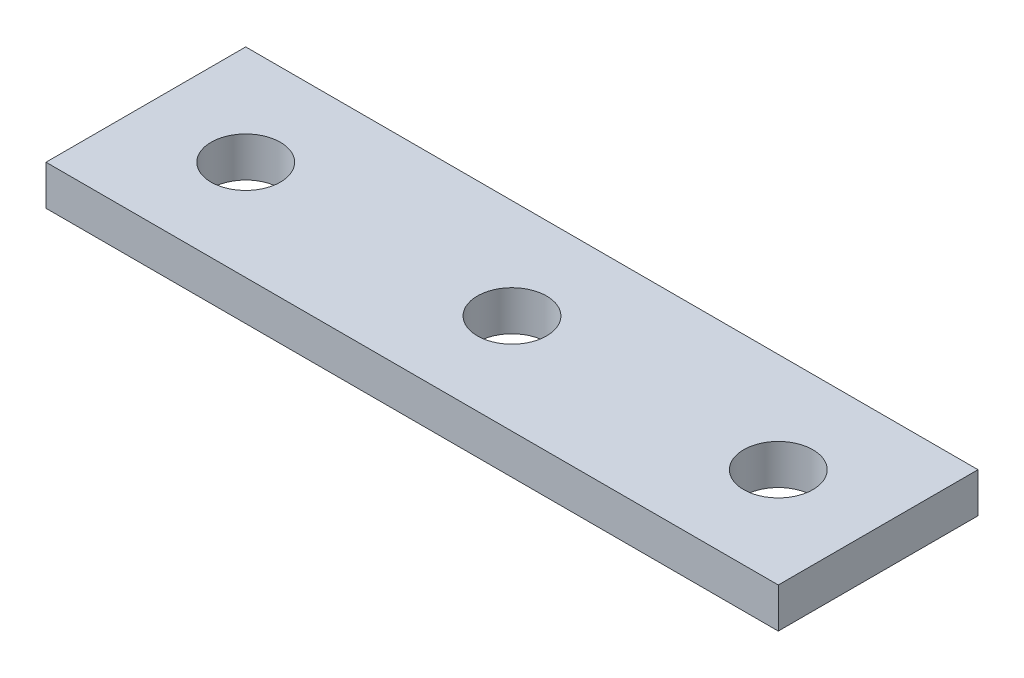
ISO-10303-21;
HEADER;
FILE_DESCRIPTION(('STEP AP214'),'2;1');
FILE_NAME('part.step','',(''),(''),'','','');
FILE_SCHEMA(('AUTOMOTIVE_DESIGN { 1 0 10303 214 1 1 1 1 }'));
ENDSEC;
DATA;
#1=APPLICATION_CONTEXT('core data for automotive mechanical design processes');
#2=APPLICATION_PROTOCOL_DEFINITION('international standard','automotive_design',2000,#1);
#3=PRODUCT_CONTEXT('',#1,'mechanical');
#4=PRODUCT('Part','Part','',(#3));
#5=PRODUCT_RELATED_PRODUCT_CATEGORY('part','',(#4));
#6=PRODUCT_DEFINITION_FORMATION('','',#4);
#7=PRODUCT_DEFINITION_CONTEXT('part definition',#1,'design');
#8=PRODUCT_DEFINITION('design','',#6,#7);
#9=PRODUCT_DEFINITION_SHAPE('','',#8);
#10=(LENGTH_UNIT() NAMED_UNIT(*) SI_UNIT(.MILLI.,.METRE.));
#11=(NAMED_UNIT(*) PLANE_ANGLE_UNIT() SI_UNIT($,.RADIAN.));
#12=(NAMED_UNIT(*) SI_UNIT($,.STERADIAN.) SOLID_ANGLE_UNIT());
#13=UNCERTAINTY_MEASURE_WITH_UNIT(LENGTH_MEASURE(1.E-05),#10,'distance_accuracy_value','');
#14=(GEOMETRIC_REPRESENTATION_CONTEXT(3) GLOBAL_UNCERTAINTY_ASSIGNED_CONTEXT((#13)) GLOBAL_UNIT_ASSIGNED_CONTEXT((#10,
#11,#12)) REPRESENTATION_CONTEXT('',''));
#15=CARTESIAN_POINT('',(0.,0.,0.));
#16=DIRECTION('',(0.,0.,1.));
#17=DIRECTION('',(1.,0.,0.));
#18=AXIS2_PLACEMENT_3D('',#15,#16,#17);
#19=CARTESIAN_POINT('',(0.,3.,0.));
#20=DIRECTION('',(0.,1.,0.));
#21=DIRECTION('',(0.,0.,1.));
#22=AXIS2_PLACEMENT_3D('',#19,#20,#21);
#23=PLANE('',#22);
#24=CARTESIAN_POINT('',(20.,3.,0.));
#25=DIRECTION('',(0.,1.,0.));
#26=DIRECTION('',(0.,0.,1.));
#27=AXIS2_PLACEMENT_3D('',#24,#25,#26);
#28=CIRCLE('',#27,2.6);
#29=CARTESIAN_POINT('',(20.,3.,2.6));
#30=VERTEX_POINT('',#29);
#31=EDGE_CURVE('E116',#30,#30,#28,.T.);
#32=ORIENTED_EDGE('',*,*,#31,.F.);
#33=EDGE_LOOP('',(#32));
#34=FACE_BOUND('',#33,.T.);
#35=DIRECTION('',(0.,0.,-1.));
#36=VECTOR('',#35,1.);
#37=CARTESIAN_POINT('',(27.5,3.,-7.5));
#38=LINE('',#37,#36);
#39=CARTESIAN_POINT('',(27.5,3.,7.5));
#40=VERTEX_POINT('',#39);
#41=CARTESIAN_POINT('',(27.5,3.,-7.5));
#42=VERTEX_POINT('',#41);
#43=EDGE_CURVE('E86',#40,#42,#38,.T.);
#44=ORIENTED_EDGE('',*,*,#43,.T.);
#45=DIRECTION('',(-1.,0.,0.));
#46=VECTOR('',#45,1.);
#47=CARTESIAN_POINT('',(-27.5,3.,-7.5));
#48=LINE('',#47,#46);
#49=CARTESIAN_POINT('',(-27.5,3.,-7.5));
#50=VERTEX_POINT('',#49);
#51=EDGE_CURVE('E81',#42,#50,#48,.T.);
#52=ORIENTED_EDGE('',*,*,#51,.T.);
#53=DIRECTION('',(0.,0.,1.));
#54=VECTOR('',#53,1.);
#55=CARTESIAN_POINT('',(-27.5,3.,-7.5));
#56=LINE('',#55,#54);
#57=CARTESIAN_POINT('',(-27.5,3.,7.5));
#58=VERTEX_POINT('',#57);
#59=EDGE_CURVE('E84',#50,#58,#56,.T.);
#60=ORIENTED_EDGE('',*,*,#59,.T.);
#61=DIRECTION('',(1.,0.,0.));
#62=VECTOR('',#61,1.);
#63=CARTESIAN_POINT('',(-27.5,3.,7.5));
#64=LINE('',#63,#62);
#65=EDGE_CURVE('E51',#58,#40,#64,.T.);
#66=ORIENTED_EDGE('',*,*,#65,.T.);
#67=EDGE_LOOP('',(#44,#52,#60,#66));
#68=FACE_BOUND('',#67,.T.);
#69=CARTESIAN_POINT('',(0.,3.,0.));
#70=DIRECTION('',(0.,1.,0.));
#71=DIRECTION('',(0.,0.,1.));
#72=AXIS2_PLACEMENT_3D('',#69,#70,#71);
#73=CIRCLE('',#72,2.6);
#74=CARTESIAN_POINT('',(0.,3.,2.6));
#75=VERTEX_POINT('',#74);
#76=EDGE_CURVE('E101',#75,#75,#73,.T.);
#77=ORIENTED_EDGE('',*,*,#76,.F.);
#78=EDGE_LOOP('',(#77));
#79=FACE_BOUND('',#78,.T.);
#80=CARTESIAN_POINT('',(-20.,3.,0.));
#81=DIRECTION('',(0.,1.,0.));
#82=DIRECTION('',(0.,0.,1.));
#83=AXIS2_PLACEMENT_3D('',#80,#81,#82);
#84=CIRCLE('',#83,2.6);
#85=CARTESIAN_POINT('',(-20.,3.,2.6));
#86=VERTEX_POINT('',#85);
#87=EDGE_CURVE('E122',#86,#86,#84,.T.);
#88=ORIENTED_EDGE('',*,*,#87,.F.);
#89=EDGE_LOOP('',(#88));
#90=FACE_BOUND('',#89,.T.);
#91=ADVANCED_FACE('F34',(#34,#68,#79,#90),#23,.T.);
#92=CARTESIAN_POINT('',(0.,0.,0.));
#93=DIRECTION('',(0.,1.,0.));
#94=DIRECTION('',(0.,0.,1.));
#95=AXIS2_PLACEMENT_3D('',#92,#93,#94);
#96=PLANE('',#95);
#97=DIRECTION('',(0.,0.,-1.));
#98=VECTOR('',#97,1.);
#99=CARTESIAN_POINT('',(27.5,0.,-7.5));
#100=LINE('',#99,#98);
#101=CARTESIAN_POINT('',(27.5,0.,7.5));
#102=VERTEX_POINT('',#101);
#103=CARTESIAN_POINT('',(27.5,0.,-7.5));
#104=VERTEX_POINT('',#103);
#105=EDGE_CURVE('E98',#102,#104,#100,.T.);
#106=ORIENTED_EDGE('',*,*,#105,.F.);
#107=DIRECTION('',(1.,0.,0.));
#108=VECTOR('',#107,1.);
#109=CARTESIAN_POINT('',(-27.5,0.,7.5));
#110=LINE('',#109,#108);
#111=CARTESIAN_POINT('',(-27.5,0.,7.5));
#112=VERTEX_POINT('',#111);
#113=EDGE_CURVE('E74',#112,#102,#110,.T.);
#114=ORIENTED_EDGE('',*,*,#113,.F.);
#115=DIRECTION('',(0.,0.,1.));
#116=VECTOR('',#115,1.);
#117=CARTESIAN_POINT('',(-27.5,0.,-7.5));
#118=LINE('',#117,#116);
#119=CARTESIAN_POINT('',(-27.5,0.,-7.5));
#120=VERTEX_POINT('',#119);
#121=EDGE_CURVE('E68',#120,#112,#118,.T.);
#122=ORIENTED_EDGE('',*,*,#121,.F.);
#123=DIRECTION('',(-1.,0.,0.));
#124=VECTOR('',#123,1.);
#125=CARTESIAN_POINT('',(-27.5,0.,-7.5));
#126=LINE('',#125,#124);
#127=EDGE_CURVE('E90',#104,#120,#126,.T.);
#128=ORIENTED_EDGE('',*,*,#127,.F.);
#129=EDGE_LOOP('',(#106,#114,#122,#128));
#130=FACE_BOUND('',#129,.T.);
#131=CARTESIAN_POINT('',(0.,0.,0.));
#132=DIRECTION('',(0.,1.,0.));
#133=DIRECTION('',(0.,0.,1.));
#134=AXIS2_PLACEMENT_3D('',#131,#132,#133);
#135=CIRCLE('',#134,2.6);
#136=CARTESIAN_POINT('',(0.,0.,2.6));
#137=VERTEX_POINT('',#136);
#138=EDGE_CURVE('E113',#137,#137,#135,.T.);
#139=ORIENTED_EDGE('',*,*,#138,.T.);
#140=EDGE_LOOP('',(#139));
#141=FACE_BOUND('',#140,.T.);
#142=CARTESIAN_POINT('',(20.,0.,0.));
#143=DIRECTION('',(0.,1.,0.));
#144=DIRECTION('',(0.,0.,1.));
#145=AXIS2_PLACEMENT_3D('',#142,#143,#144);
#146=CIRCLE('',#145,2.6);
#147=CARTESIAN_POINT('',(20.,0.,2.6));
#148=VERTEX_POINT('',#147);
#149=EDGE_CURVE('E119',#148,#148,#146,.T.);
#150=ORIENTED_EDGE('',*,*,#149,.T.);
#151=EDGE_LOOP('',(#150));
#152=FACE_BOUND('',#151,.T.);
#153=CARTESIAN_POINT('',(-20.,0.,0.));
#154=DIRECTION('',(0.,1.,0.));
#155=DIRECTION('',(0.,0.,1.));
#156=AXIS2_PLACEMENT_3D('',#153,#154,#155);
#157=CIRCLE('',#156,2.6);
#158=CARTESIAN_POINT('',(-20.,0.,2.6));
#159=VERTEX_POINT('',#158);
#160=EDGE_CURVE('E125',#159,#159,#157,.T.);
#161=ORIENTED_EDGE('',*,*,#160,.T.);
#162=EDGE_LOOP('',(#161));
#163=FACE_BOUND('',#162,.T.);
#164=ADVANCED_FACE('F109',(#130,#141,#152,#163),#96,.F.);
#165=CARTESIAN_POINT('',(27.5,3.,-7.5));
#166=DIRECTION('',(-1.,0.,0.));
#167=DIRECTION('',(0.,0.,1.));
#168=AXIS2_PLACEMENT_3D('',#165,#166,#167);
#169=PLANE('',#168);
#170=ORIENTED_EDGE('',*,*,#105,.T.);
#171=DIRECTION('',(0.,-1.,0.));
#172=VECTOR('',#171,1.);
#173=CARTESIAN_POINT('',(27.5,3.,-7.5));
#174=LINE('',#173,#172);
#175=EDGE_CURVE('E11',#42,#104,#174,.T.);
#176=ORIENTED_EDGE('',*,*,#175,.F.);
#177=ORIENTED_EDGE('',*,*,#43,.F.);
#178=DIRECTION('',(0.,-1.,0.));
#179=VECTOR('',#178,1.);
#180=CARTESIAN_POINT('',(27.5,3.,7.5));
#181=LINE('',#180,#179);
#182=EDGE_CURVE('E94',#40,#102,#181,.T.);
#183=ORIENTED_EDGE('',*,*,#182,.T.);
#184=EDGE_LOOP('',(#170,#176,#177,#183));
#185=FACE_BOUND('',#184,.T.);
#186=ADVANCED_FACE('F36',(#185),#169,.F.);
#187=CARTESIAN_POINT('',(-27.5,3.,-7.5));
#188=DIRECTION('',(0.,0.,1.));
#189=DIRECTION('',(1.,0.,0.));
#190=AXIS2_PLACEMENT_3D('',#187,#188,#189);
#191=PLANE('',#190);
#192=ORIENTED_EDGE('',*,*,#127,.T.);
#193=DIRECTION('',(0.,-1.,0.));
#194=VECTOR('',#193,1.);
#195=CARTESIAN_POINT('',(-27.5,3.,-7.5));
#196=LINE('',#195,#194);
#197=EDGE_CURVE('E43',#50,#120,#196,.T.);
#198=ORIENTED_EDGE('',*,*,#197,.F.);
#199=ORIENTED_EDGE('',*,*,#51,.F.);
#200=ORIENTED_EDGE('',*,*,#175,.T.);
#201=EDGE_LOOP('',(#192,#198,#199,#200));
#202=FACE_BOUND('',#201,.T.);
#203=ADVANCED_FACE('F89',(#202),#191,.F.);
#204=CARTESIAN_POINT('',(-27.5,3.,-7.5));
#205=DIRECTION('',(1.,0.,0.));
#206=DIRECTION('',(0.,0.,-1.));
#207=AXIS2_PLACEMENT_3D('',#204,#205,#206);
#208=PLANE('',#207);
#209=ORIENTED_EDGE('',*,*,#121,.T.);
#210=DIRECTION('',(0.,-1.,0.));
#211=VECTOR('',#210,1.);
#212=CARTESIAN_POINT('',(-27.5,3.,7.5));
#213=LINE('',#212,#211);
#214=EDGE_CURVE('E91',#58,#112,#213,.T.);
#215=ORIENTED_EDGE('',*,*,#214,.F.);
#216=ORIENTED_EDGE('',*,*,#59,.F.);
#217=ORIENTED_EDGE('',*,*,#197,.T.);
#218=EDGE_LOOP('',(#209,#215,#216,#217));
#219=FACE_BOUND('',#218,.T.);
#220=ADVANCED_FACE('F92',(#219),#208,.F.);
#221=CARTESIAN_POINT('',(-27.5,3.,7.5));
#222=DIRECTION('',(0.,0.,-1.));
#223=DIRECTION('',(-1.,0.,0.));
#224=AXIS2_PLACEMENT_3D('',#221,#222,#223);
#225=PLANE('',#224);
#226=ORIENTED_EDGE('',*,*,#113,.T.);
#227=ORIENTED_EDGE('',*,*,#182,.F.);
#228=ORIENTED_EDGE('',*,*,#65,.F.);
#229=ORIENTED_EDGE('',*,*,#214,.T.);
#230=EDGE_LOOP('',(#226,#227,#228,#229));
#231=FACE_BOUND('',#230,.T.);
#232=ADVANCED_FACE('F106',(#231),#225,.F.);
#233=CARTESIAN_POINT('',(0.,3.,0.));
#234=DIRECTION('',(0.,-1.,0.));
#235=DIRECTION('',(0.,0.,-1.));
#236=AXIS2_PLACEMENT_3D('',#233,#234,#235);
#237=CYLINDRICAL_SURFACE('',#236,2.6);
#238=ORIENTED_EDGE('',*,*,#76,.T.);
#239=EDGE_LOOP('',(#238));
#240=FACE_BOUND('',#239,.T.);
#241=ORIENTED_EDGE('',*,*,#138,.F.);
#242=EDGE_LOOP('',(#241));
#243=FACE_BOUND('',#242,.T.);
#244=ADVANCED_FACE('F143',(#240,#243),#237,.F.);
#245=CARTESIAN_POINT('',(20.,3.,0.));
#246=DIRECTION('',(0.,-1.,0.));
#247=DIRECTION('',(0.,0.,-1.));
#248=AXIS2_PLACEMENT_3D('',#245,#246,#247);
#249=CYLINDRICAL_SURFACE('',#248,2.6);
#250=ORIENTED_EDGE('',*,*,#31,.T.);
#251=EDGE_LOOP('',(#250));
#252=FACE_BOUND('',#251,.T.);
#253=ORIENTED_EDGE('',*,*,#149,.F.);
#254=EDGE_LOOP('',(#253));
#255=FACE_BOUND('',#254,.T.);
#256=ADVANCED_FACE('F189',(#252,#255),#249,.F.);
#257=CARTESIAN_POINT('',(-20.,3.,0.));
#258=DIRECTION('',(0.,-1.,0.));
#259=DIRECTION('',(0.,0.,-1.));
#260=AXIS2_PLACEMENT_3D('',#257,#258,#259);
#261=CYLINDRICAL_SURFACE('',#260,2.6);
#262=ORIENTED_EDGE('',*,*,#87,.T.);
#263=EDGE_LOOP('',(#262));
#264=FACE_BOUND('',#263,.T.);
#265=ORIENTED_EDGE('',*,*,#160,.F.);
#266=EDGE_LOOP('',(#265));
#267=FACE_BOUND('',#266,.T.);
#268=ADVANCED_FACE('F131',(#264,#267),#261,.F.);
#269=CLOSED_SHELL('',(#91,#164,#186,#203,#220,#232,#244,#256,#268));
#270=MANIFOLD_SOLID_BREP('B2',#269);
#271=ADVANCED_BREP_SHAPE_REPRESENTATION('',(#18,#270),#14);
#272=SHAPE_DEFINITION_REPRESENTATION(#9,#271);
ENDSEC;
END-ISO-10303-21;
